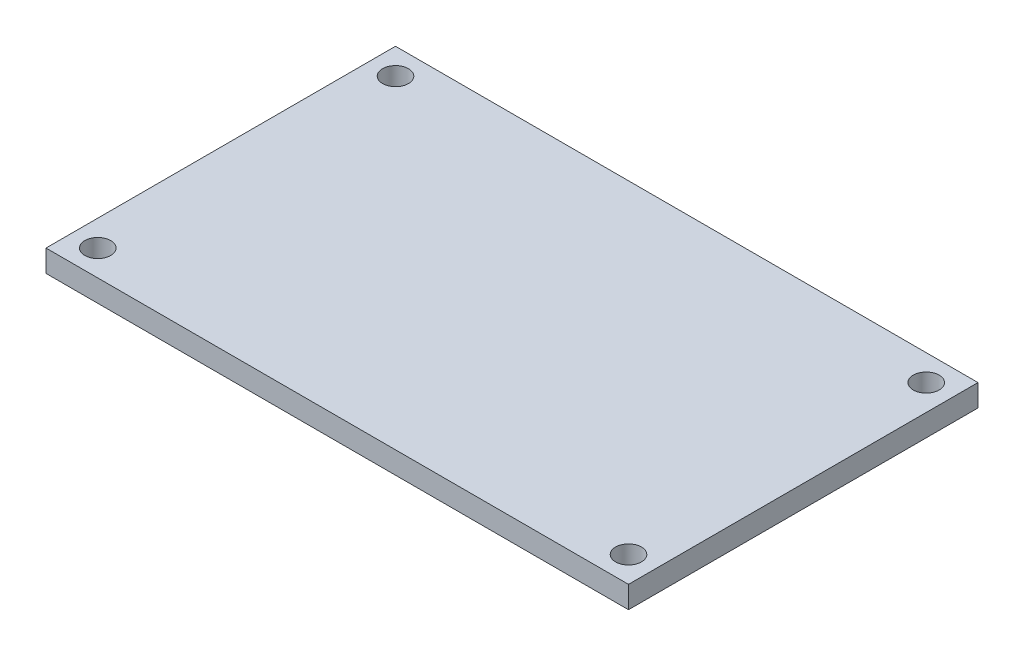
ISO-10303-21;
HEADER;
FILE_DESCRIPTION(('STEP AP214'),'2;1');
FILE_NAME('part.step','',(''),(''),'','','');
FILE_SCHEMA(('AUTOMOTIVE_DESIGN { 1 0 10303 214 1 1 1 1 }'));
ENDSEC;
DATA;
#1=APPLICATION_CONTEXT('core data for automotive mechanical design processes');
#2=APPLICATION_PROTOCOL_DEFINITION('international standard','automotive_design',2000,#1);
#3=PRODUCT_CONTEXT('',#1,'mechanical');
#4=PRODUCT('Part','Part','',(#3));
#5=PRODUCT_RELATED_PRODUCT_CATEGORY('part','',(#4));
#6=PRODUCT_DEFINITION_FORMATION('','',#4);
#7=PRODUCT_DEFINITION_CONTEXT('part definition',#1,'design');
#8=PRODUCT_DEFINITION('design','',#6,#7);
#9=PRODUCT_DEFINITION_SHAPE('','',#8);
#10=(LENGTH_UNIT() NAMED_UNIT(*) SI_UNIT(.MILLI.,.METRE.));
#11=(NAMED_UNIT(*) PLANE_ANGLE_UNIT() SI_UNIT($,.RADIAN.));
#12=(NAMED_UNIT(*) SI_UNIT($,.STERADIAN.) SOLID_ANGLE_UNIT());
#13=UNCERTAINTY_MEASURE_WITH_UNIT(LENGTH_MEASURE(1.E-05),#10,'distance_accuracy_value','');
#14=(GEOMETRIC_REPRESENTATION_CONTEXT(3) GLOBAL_UNCERTAINTY_ASSIGNED_CONTEXT((#13)) GLOBAL_UNIT_ASSIGNED_CONTEXT((#10,
#11,#12)) REPRESENTATION_CONTEXT('',''));
#15=CARTESIAN_POINT('',(0.,0.,0.));
#16=DIRECTION('',(0.,0.,1.));
#17=DIRECTION('',(1.,0.,0.));
#18=AXIS2_PLACEMENT_3D('',#15,#16,#17);
#19=CARTESIAN_POINT('',(0.,0.,-27.));
#20=DIRECTION('',(0.,-1.,0.));
#21=DIRECTION('',(0.,0.,-1.));
#22=AXIS2_PLACEMENT_3D('',#19,#20,#21);
#23=PLANE('',#22);
#24=CARTESIAN_POINT('',(2.,0.,-2.));
#25=DIRECTION('',(0.,-1.,0.));
#26=DIRECTION('',(0.,0.,1.));
#27=AXIS2_PLACEMENT_3D('',#24,#25,#26);
#28=CIRCLE('',#27,1.);
#29=CARTESIAN_POINT('',(2.,0.,-0.999999999999997));
#30=VERTEX_POINT('',#29);
#31=EDGE_CURVE('E263',#30,#30,#28,.T.);
#32=ORIENTED_EDGE('',*,*,#31,.F.);
#33=EDGE_LOOP('',(#32));
#34=FACE_BOUND('',#33,.T.);
#35=CARTESIAN_POINT('',(43.,0.,-2.00000000000002));
#36=DIRECTION('',(0.,-1.,0.));
#37=DIRECTION('',(0.,0.,-1.));
#38=AXIS2_PLACEMENT_3D('',#35,#36,#37);
#39=CIRCLE('',#38,0.999999999999998);
#40=CARTESIAN_POINT('',(43.,0.,-3.00000000000002));
#41=VERTEX_POINT('',#40);
#42=EDGE_CURVE('E265',#41,#41,#39,.T.);
#43=ORIENTED_EDGE('',*,*,#42,.F.);
#44=EDGE_LOOP('',(#43));
#45=FACE_BOUND('',#44,.T.);
#46=CARTESIAN_POINT('',(43.,0.,-25.));
#47=DIRECTION('',(0.,-1.,0.));
#48=DIRECTION('',(0.,0.,1.));
#49=AXIS2_PLACEMENT_3D('',#46,#47,#48);
#50=CIRCLE('',#49,0.999999999999998);
#51=CARTESIAN_POINT('',(43.,0.,-24.));
#52=VERTEX_POINT('',#51);
#53=EDGE_CURVE('E271',#52,#52,#50,.T.);
#54=ORIENTED_EDGE('',*,*,#53,.F.);
#55=EDGE_LOOP('',(#54));
#56=FACE_BOUND('',#55,.T.);
#57=CARTESIAN_POINT('',(2.,0.,-25.));
#58=DIRECTION('',(0.,-1.,0.));
#59=DIRECTION('',(0.,0.,-1.));
#60=AXIS2_PLACEMENT_3D('',#57,#58,#59);
#61=CIRCLE('',#60,1.);
#62=CARTESIAN_POINT('',(2.,0.,-26.));
#63=VERTEX_POINT('',#62);
#64=EDGE_CURVE('E277',#63,#63,#61,.T.);
#65=ORIENTED_EDGE('',*,*,#64,.F.);
#66=EDGE_LOOP('',(#65));
#67=FACE_BOUND('',#66,.T.);
#68=DIRECTION('',(0.,0.,1.));
#69=VECTOR('',#68,1.);
#70=CARTESIAN_POINT('',(0.,0.,0.));
#71=LINE('',#70,#69);
#72=CARTESIAN_POINT('',(0.,0.,-27.));
#73=VERTEX_POINT('',#72);
#74=CARTESIAN_POINT('',(0.,0.,0.));
#75=VERTEX_POINT('',#74);
#76=EDGE_CURVE('E157',#73,#75,#71,.T.);
#77=ORIENTED_EDGE('',*,*,#76,.F.);
#78=DIRECTION('',(-1.,0.,0.));
#79=VECTOR('',#78,1.);
#80=CARTESIAN_POINT('',(0.,0.,-27.));
#81=LINE('',#80,#79);
#82=CARTESIAN_POINT('',(45.,0.,-27.));
#83=VERTEX_POINT('',#82);
#84=EDGE_CURVE('E79',#83,#73,#81,.T.);
#85=ORIENTED_EDGE('',*,*,#84,.F.);
#86=DIRECTION('',(0.,0.,-1.));
#87=VECTOR('',#86,1.);
#88=CARTESIAN_POINT('',(45.,0.,0.));
#89=LINE('',#88,#87);
#90=CARTESIAN_POINT('',(45.,0.,0.));
#91=VERTEX_POINT('',#90);
#92=EDGE_CURVE('E174',#91,#83,#89,.T.);
#93=ORIENTED_EDGE('',*,*,#92,.F.);
#94=DIRECTION('',(1.,0.,0.));
#95=VECTOR('',#94,1.);
#96=CARTESIAN_POINT('',(0.,0.,0.));
#97=LINE('',#96,#95);
#98=EDGE_CURVE('E160',#75,#91,#97,.T.);
#99=ORIENTED_EDGE('',*,*,#98,.F.);
#100=EDGE_LOOP('',(#77,#85,#93,#99));
#101=FACE_BOUND('',#100,.T.);
#102=DIRECTION('',(0.707106781186547,0.,-0.707106781186548));
#103=VECTOR('',#102,1.);
#104=CARTESIAN_POINT('',(3.,0.,-22.5));
#105=LINE('',#104,#103);
#106=CARTESIAN_POINT('',(3.,0.,-22.5));
#107=VERTEX_POINT('',#106);
#108=CARTESIAN_POINT('',(5.,0.,-24.5));
#109=VERTEX_POINT('',#108);
#110=EDGE_CURVE('E297',#107,#109,#105,.T.);
#111=ORIENTED_EDGE('',*,*,#110,.F.);
#112=DIRECTION('',(0.,0.,-1.));
#113=VECTOR('',#112,1.);
#114=CARTESIAN_POINT('',(3.,0.,-4.5));
#115=LINE('',#114,#113);
#116=CARTESIAN_POINT('',(3.,0.,-4.5));
#117=VERTEX_POINT('',#116);
#118=EDGE_CURVE('E155',#117,#107,#115,.T.);
#119=ORIENTED_EDGE('',*,*,#118,.F.);
#120=DIRECTION('',(-0.707106781186547,0.,-0.707106781186548));
#121=VECTOR('',#120,1.);
#122=CARTESIAN_POINT('',(5.,0.,-2.5));
#123=LINE('',#122,#121);
#124=CARTESIAN_POINT('',(5.,0.,-2.5));
#125=VERTEX_POINT('',#124);
#126=EDGE_CURVE('E151',#125,#117,#123,.T.);
#127=ORIENTED_EDGE('',*,*,#126,.F.);
#128=DIRECTION('',(-1.,0.,0.));
#129=VECTOR('',#128,1.);
#130=CARTESIAN_POINT('',(5.,0.,-2.5));
#131=LINE('',#130,#129);
#132=CARTESIAN_POINT('',(40.,0.,-2.5));
#133=VERTEX_POINT('',#132);
#134=EDGE_CURVE('E307',#133,#125,#131,.T.);
#135=ORIENTED_EDGE('',*,*,#134,.F.);
#136=DIRECTION('',(-0.707106781186548,0.,0.707106781186547));
#137=VECTOR('',#136,1.);
#138=CARTESIAN_POINT('',(40.,0.,-2.5));
#139=LINE('',#138,#137);
#140=CARTESIAN_POINT('',(42.,0.,-4.5));
#141=VERTEX_POINT('',#140);
#142=EDGE_CURVE('E305',#141,#133,#139,.T.);
#143=ORIENTED_EDGE('',*,*,#142,.F.);
#144=DIRECTION('',(0.,0.,1.));
#145=VECTOR('',#144,1.);
#146=CARTESIAN_POINT('',(42.,0.,-4.5));
#147=LINE('',#146,#145);
#148=CARTESIAN_POINT('',(42.,0.,-22.5));
#149=VERTEX_POINT('',#148);
#150=EDGE_CURVE('E303',#149,#141,#147,.T.);
#151=ORIENTED_EDGE('',*,*,#150,.F.);
#152=DIRECTION('',(0.707106781186547,0.,0.707106781186547));
#153=VECTOR('',#152,1.);
#154=CARTESIAN_POINT('',(40.,0.,-24.5));
#155=LINE('',#154,#153);
#156=CARTESIAN_POINT('',(40.,0.,-24.5));
#157=VERTEX_POINT('',#156);
#158=EDGE_CURVE('E301',#157,#149,#155,.T.);
#159=ORIENTED_EDGE('',*,*,#158,.F.);
#160=DIRECTION('',(1.,0.,0.));
#161=VECTOR('',#160,1.);
#162=CARTESIAN_POINT('',(5.,0.,-24.5));
#163=LINE('',#162,#161);
#164=EDGE_CURVE('E299',#109,#157,#163,.T.);
#165=ORIENTED_EDGE('',*,*,#164,.F.);
#166=EDGE_LOOP('',(#111,#119,#127,#135,#143,#151,#159,#165));
#167=FACE_BOUND('',#166,.T.);
#168=ADVANCED_FACE('F34',(#34,#45,#56,#67,#101,#167),#23,.T.);
#169=CARTESIAN_POINT('',(0.,1.7,0.));
#170=DIRECTION('',(1.,0.,0.));
#171=DIRECTION('',(0.,0.,-1.));
#172=AXIS2_PLACEMENT_3D('',#169,#170,#171);
#173=PLANE('',#172);
#174=ORIENTED_EDGE('',*,*,#76,.T.);
#175=DIRECTION('',(0.,-1.,0.));
#176=VECTOR('',#175,1.);
#177=CARTESIAN_POINT('',(0.,1.7,0.));
#178=LINE('',#177,#176);
#179=CARTESIAN_POINT('',(0.,1.7,0.));
#180=VERTEX_POINT('',#179);
#181=EDGE_CURVE('E11',#180,#75,#178,.T.);
#182=ORIENTED_EDGE('',*,*,#181,.F.);
#183=DIRECTION('',(0.,0.,1.));
#184=VECTOR('',#183,1.);
#185=CARTESIAN_POINT('',(0.,1.7,0.));
#186=LINE('',#185,#184);
#187=CARTESIAN_POINT('',(0.,1.7,-27.));
#188=VERTEX_POINT('',#187);
#189=EDGE_CURVE('E166',#188,#180,#186,.T.);
#190=ORIENTED_EDGE('',*,*,#189,.F.);
#191=DIRECTION('',(0.,-1.,0.));
#192=VECTOR('',#191,1.);
#193=CARTESIAN_POINT('',(0.,1.7,-27.));
#194=LINE('',#193,#192);
#195=EDGE_CURVE('E171',#188,#73,#194,.T.);
#196=ORIENTED_EDGE('',*,*,#195,.T.);
#197=EDGE_LOOP('',(#174,#182,#190,#196));
#198=FACE_BOUND('',#197,.T.);
#199=ADVANCED_FACE('F36',(#198),#173,.F.);
#200=CARTESIAN_POINT('',(0.,1.7,0.));
#201=DIRECTION('',(0.,0.,-1.));
#202=DIRECTION('',(-1.,0.,0.));
#203=AXIS2_PLACEMENT_3D('',#200,#201,#202);
#204=PLANE('',#203);
#205=ORIENTED_EDGE('',*,*,#98,.T.);
#206=DIRECTION('',(0.,-1.,0.));
#207=VECTOR('',#206,1.);
#208=CARTESIAN_POINT('',(45.,1.7,0.));
#209=LINE('',#208,#207);
#210=CARTESIAN_POINT('',(45.,1.7,0.));
#211=VERTEX_POINT('',#210);
#212=EDGE_CURVE('E42',#211,#91,#209,.T.);
#213=ORIENTED_EDGE('',*,*,#212,.F.);
#214=DIRECTION('',(1.,0.,0.));
#215=VECTOR('',#214,1.);
#216=CARTESIAN_POINT('',(0.,1.7,0.));
#217=LINE('',#216,#215);
#218=EDGE_CURVE('E86',#180,#211,#217,.T.);
#219=ORIENTED_EDGE('',*,*,#218,.F.);
#220=ORIENTED_EDGE('',*,*,#181,.T.);
#221=EDGE_LOOP('',(#205,#213,#219,#220));
#222=FACE_BOUND('',#221,.T.);
#223=ADVANCED_FACE('F201',(#222),#204,.F.);
#224=CARTESIAN_POINT('',(45.,1.7,0.));
#225=DIRECTION('',(-1.,0.,0.));
#226=DIRECTION('',(0.,0.,1.));
#227=AXIS2_PLACEMENT_3D('',#224,#225,#226);
#228=PLANE('',#227);
#229=ORIENTED_EDGE('',*,*,#92,.T.);
#230=DIRECTION('',(0.,-1.,0.));
#231=VECTOR('',#230,1.);
#232=CARTESIAN_POINT('',(45.,1.7,-27.));
#233=LINE('',#232,#231);
#234=CARTESIAN_POINT('',(45.,1.7,-27.));
#235=VERTEX_POINT('',#234);
#236=EDGE_CURVE('E178',#235,#83,#233,.T.);
#237=ORIENTED_EDGE('',*,*,#236,.F.);
#238=DIRECTION('',(0.,0.,-1.));
#239=VECTOR('',#238,1.);
#240=CARTESIAN_POINT('',(45.,1.7,0.));
#241=LINE('',#240,#239);
#242=EDGE_CURVE('E169',#211,#235,#241,.T.);
#243=ORIENTED_EDGE('',*,*,#242,.F.);
#244=ORIENTED_EDGE('',*,*,#212,.T.);
#245=EDGE_LOOP('',(#229,#237,#243,#244));
#246=FACE_BOUND('',#245,.T.);
#247=ADVANCED_FACE('F183',(#246),#228,.F.);
#248=CARTESIAN_POINT('',(0.,1.7,-27.));
#249=DIRECTION('',(0.,0.,1.));
#250=DIRECTION('',(1.,0.,0.));
#251=AXIS2_PLACEMENT_3D('',#248,#249,#250);
#252=PLANE('',#251);
#253=ORIENTED_EDGE('',*,*,#84,.T.);
#254=ORIENTED_EDGE('',*,*,#195,.F.);
#255=DIRECTION('',(-1.,0.,0.));
#256=VECTOR('',#255,1.);
#257=CARTESIAN_POINT('',(0.,1.7,-27.));
#258=LINE('',#257,#256);
#259=EDGE_CURVE('E58',#235,#188,#258,.T.);
#260=ORIENTED_EDGE('',*,*,#259,.F.);
#261=ORIENTED_EDGE('',*,*,#236,.T.);
#262=EDGE_LOOP('',(#253,#254,#260,#261));
#263=FACE_BOUND('',#262,.T.);
#264=ADVANCED_FACE('F191',(#263),#252,.F.);
#265=CARTESIAN_POINT('',(0.,1.7,-27.));
#266=DIRECTION('',(0.,-1.,0.));
#267=DIRECTION('',(0.,0.,-1.));
#268=AXIS2_PLACEMENT_3D('',#265,#266,#267);
#269=PLANE('',#268);
#270=CARTESIAN_POINT('',(2.,1.7,-2.));
#271=DIRECTION('',(0.,-1.,0.));
#272=DIRECTION('',(0.,0.,1.));
#273=AXIS2_PLACEMENT_3D('',#270,#271,#272);
#274=CIRCLE('',#273,1.);
#275=CARTESIAN_POINT('',(2.,1.7,-0.999999999999997));
#276=VERTEX_POINT('',#275);
#277=EDGE_CURVE('E261',#276,#276,#274,.T.);
#278=ORIENTED_EDGE('',*,*,#277,.T.);
#279=EDGE_LOOP('',(#278));
#280=FACE_BOUND('',#279,.T.);
#281=CARTESIAN_POINT('',(43.,1.7,-2.00000000000002));
#282=DIRECTION('',(0.,-1.,0.));
#283=DIRECTION('',(0.,0.,-1.));
#284=AXIS2_PLACEMENT_3D('',#281,#282,#283);
#285=CIRCLE('',#284,0.999999999999998);
#286=CARTESIAN_POINT('',(43.,1.7,-3.00000000000002));
#287=VERTEX_POINT('',#286);
#288=EDGE_CURVE('E268',#287,#287,#285,.T.);
#289=ORIENTED_EDGE('',*,*,#288,.T.);
#290=EDGE_LOOP('',(#289));
#291=FACE_BOUND('',#290,.T.);
#292=CARTESIAN_POINT('',(43.,1.7,-25.));
#293=DIRECTION('',(0.,-1.,0.));
#294=DIRECTION('',(0.,0.,1.));
#295=AXIS2_PLACEMENT_3D('',#292,#293,#294);
#296=CIRCLE('',#295,0.999999999999998);
#297=CARTESIAN_POINT('',(43.,1.7,-24.));
#298=VERTEX_POINT('',#297);
#299=EDGE_CURVE('E274',#298,#298,#296,.T.);
#300=ORIENTED_EDGE('',*,*,#299,.T.);
#301=EDGE_LOOP('',(#300));
#302=FACE_BOUND('',#301,.T.);
#303=CARTESIAN_POINT('',(2.,1.7,-25.));
#304=DIRECTION('',(0.,-1.,0.));
#305=DIRECTION('',(0.,0.,-1.));
#306=AXIS2_PLACEMENT_3D('',#303,#304,#305);
#307=CIRCLE('',#306,1.);
#308=CARTESIAN_POINT('',(2.,1.7,-26.));
#309=VERTEX_POINT('',#308);
#310=EDGE_CURVE('E280',#309,#309,#307,.T.);
#311=ORIENTED_EDGE('',*,*,#310,.T.);
#312=EDGE_LOOP('',(#311));
#313=FACE_BOUND('',#312,.T.);
#314=ORIENTED_EDGE('',*,*,#189,.T.);
#315=ORIENTED_EDGE('',*,*,#218,.T.);
#316=ORIENTED_EDGE('',*,*,#242,.T.);
#317=ORIENTED_EDGE('',*,*,#259,.T.);
#318=EDGE_LOOP('',(#314,#315,#316,#317));
#319=FACE_BOUND('',#318,.T.);
#320=ADVANCED_FACE('F193',(#280,#291,#302,#313,#319),#269,.F.);
#321=CARTESIAN_POINT('',(3.,-1.,-4.5));
#322=DIRECTION('',(1.,0.,0.));
#323=DIRECTION('',(0.,0.,-1.));
#324=AXIS2_PLACEMENT_3D('',#321,#322,#323);
#325=PLANE('',#324);
#326=ORIENTED_EDGE('',*,*,#118,.T.);
#327=DIRECTION('',(0.,1.,0.));
#328=VECTOR('',#327,1.);
#329=CARTESIAN_POINT('',(3.,-1.,-22.5));
#330=LINE('',#329,#328);
#331=CARTESIAN_POINT('',(3.,-1.,-22.5));
#332=VERTEX_POINT('',#331);
#333=EDGE_CURVE('E136',#332,#107,#330,.T.);
#334=ORIENTED_EDGE('',*,*,#333,.F.);
#335=DIRECTION('',(0.,0.,-1.));
#336=VECTOR('',#335,1.);
#337=CARTESIAN_POINT('',(3.,-1.,-4.5));
#338=LINE('',#337,#336);
#339=CARTESIAN_POINT('',(3.,-1.,-4.5));
#340=VERTEX_POINT('',#339);
#341=EDGE_CURVE('E143',#340,#332,#338,.T.);
#342=ORIENTED_EDGE('',*,*,#341,.F.);
#343=DIRECTION('',(0.,1.,0.));
#344=VECTOR('',#343,1.);
#345=CARTESIAN_POINT('',(3.,-1.,-4.5));
#346=LINE('',#345,#344);
#347=EDGE_CURVE('E295',#340,#117,#346,.T.);
#348=ORIENTED_EDGE('',*,*,#347,.T.);
#349=EDGE_LOOP('',(#326,#334,#342,#348));
#350=FACE_BOUND('',#349,.T.);
#351=ADVANCED_FACE('F153',(#350),#325,.F.);
#352=CARTESIAN_POINT('',(3.,-1.,-22.5));
#353=DIRECTION('',(0.707106781186548,0.,0.707106781186547));
#354=DIRECTION('',(0.707106781186547,0.,-0.707106781186548));
#355=AXIS2_PLACEMENT_3D('',#352,#353,#354);
#356=PLANE('',#355);
#357=ORIENTED_EDGE('',*,*,#110,.T.);
#358=DIRECTION('',(0.,1.,0.));
#359=VECTOR('',#358,1.);
#360=CARTESIAN_POINT('',(5.,-1.,-24.5));
#361=LINE('',#360,#359);
#362=CARTESIAN_POINT('',(5.,-1.,-24.5));
#363=VERTEX_POINT('',#362);
#364=EDGE_CURVE('E139',#363,#109,#361,.T.);
#365=ORIENTED_EDGE('',*,*,#364,.F.);
#366=DIRECTION('',(0.707106781186547,0.,-0.707106781186548));
#367=VECTOR('',#366,1.);
#368=CARTESIAN_POINT('',(3.,-1.,-22.5));
#369=LINE('',#368,#367);
#370=EDGE_CURVE('E132',#332,#363,#369,.T.);
#371=ORIENTED_EDGE('',*,*,#370,.F.);
#372=ORIENTED_EDGE('',*,*,#333,.T.);
#373=EDGE_LOOP('',(#357,#365,#371,#372));
#374=FACE_BOUND('',#373,.T.);
#375=ADVANCED_FACE('F134',(#374),#356,.F.);
#376=CARTESIAN_POINT('',(5.,-1.,-24.5));
#377=DIRECTION('',(0.,0.,1.));
#378=DIRECTION('',(1.,0.,0.));
#379=AXIS2_PLACEMENT_3D('',#376,#377,#378);
#380=PLANE('',#379);
#381=ORIENTED_EDGE('',*,*,#164,.T.);
#382=DIRECTION('',(0.,1.,0.));
#383=VECTOR('',#382,1.);
#384=CARTESIAN_POINT('',(40.,-1.,-24.5));
#385=LINE('',#384,#383);
#386=CARTESIAN_POINT('',(40.,-1.,-24.5));
#387=VERTEX_POINT('',#386);
#388=EDGE_CURVE('E162',#387,#157,#385,.T.);
#389=ORIENTED_EDGE('',*,*,#388,.F.);
#390=DIRECTION('',(1.,0.,0.));
#391=VECTOR('',#390,1.);
#392=CARTESIAN_POINT('',(5.,-1.,-24.5));
#393=LINE('',#392,#391);
#394=EDGE_CURVE('E142',#363,#387,#393,.T.);
#395=ORIENTED_EDGE('',*,*,#394,.F.);
#396=ORIENTED_EDGE('',*,*,#364,.T.);
#397=EDGE_LOOP('',(#381,#389,#395,#396));
#398=FACE_BOUND('',#397,.T.);
#399=ADVANCED_FACE('F216',(#398),#380,.F.);
#400=CARTESIAN_POINT('',(40.,-1.,-24.5));
#401=DIRECTION('',(-0.707106781186547,0.,0.707106781186547));
#402=DIRECTION('',(0.707106781186548,0.,0.707106781186548));
#403=AXIS2_PLACEMENT_3D('',#400,#401,#402);
#404=PLANE('',#403);
#405=ORIENTED_EDGE('',*,*,#158,.T.);
#406=DIRECTION('',(0.,1.,0.));
#407=VECTOR('',#406,1.);
#408=CARTESIAN_POINT('',(42.,-1.,-22.5));
#409=LINE('',#408,#407);
#410=CARTESIAN_POINT('',(42.,-1.,-22.5));
#411=VERTEX_POINT('',#410);
#412=EDGE_CURVE('E318',#411,#149,#409,.T.);
#413=ORIENTED_EDGE('',*,*,#412,.F.);
#414=DIRECTION('',(0.707106781186547,0.,0.707106781186547));
#415=VECTOR('',#414,1.);
#416=CARTESIAN_POINT('',(40.,-1.,-24.5));
#417=LINE('',#416,#415);
#418=EDGE_CURVE('E286',#387,#411,#417,.T.);
#419=ORIENTED_EDGE('',*,*,#418,.F.);
#420=ORIENTED_EDGE('',*,*,#388,.T.);
#421=EDGE_LOOP('',(#405,#413,#419,#420));
#422=FACE_BOUND('',#421,.T.);
#423=ADVANCED_FACE('F219',(#422),#404,.F.);
#424=CARTESIAN_POINT('',(42.,-1.,-4.5));
#425=DIRECTION('',(-1.,0.,0.));
#426=DIRECTION('',(0.,0.,1.));
#427=AXIS2_PLACEMENT_3D('',#424,#425,#426);
#428=PLANE('',#427);
#429=ORIENTED_EDGE('',*,*,#150,.T.);
#430=DIRECTION('',(0.,1.,0.));
#431=VECTOR('',#430,1.);
#432=CARTESIAN_POINT('',(42.,-1.,-4.5));
#433=LINE('',#432,#431);
#434=CARTESIAN_POINT('',(42.,-1.,-4.5));
#435=VERTEX_POINT('',#434);
#436=EDGE_CURVE('E315',#435,#141,#433,.T.);
#437=ORIENTED_EDGE('',*,*,#436,.F.);
#438=DIRECTION('',(0.,0.,1.));
#439=VECTOR('',#438,1.);
#440=CARTESIAN_POINT('',(42.,-1.,-4.5));
#441=LINE('',#440,#439);
#442=EDGE_CURVE('E288',#411,#435,#441,.T.);
#443=ORIENTED_EDGE('',*,*,#442,.F.);
#444=ORIENTED_EDGE('',*,*,#412,.T.);
#445=EDGE_LOOP('',(#429,#437,#443,#444));
#446=FACE_BOUND('',#445,.T.);
#447=ADVANCED_FACE('F223',(#446),#428,.F.);
#448=CARTESIAN_POINT('',(40.,-1.,-2.5));
#449=DIRECTION('',(-0.707106781186547,0.,-0.707106781186548));
#450=DIRECTION('',(-0.707106781186548,0.,0.707106781186547));
#451=AXIS2_PLACEMENT_3D('',#448,#449,#450);
#452=PLANE('',#451);
#453=ORIENTED_EDGE('',*,*,#142,.T.);
#454=DIRECTION('',(0.,1.,0.));
#455=VECTOR('',#454,1.);
#456=CARTESIAN_POINT('',(40.,-1.,-2.5));
#457=LINE('',#456,#455);
#458=CARTESIAN_POINT('',(40.,-1.,-2.5));
#459=VERTEX_POINT('',#458);
#460=EDGE_CURVE('E312',#459,#133,#457,.T.);
#461=ORIENTED_EDGE('',*,*,#460,.F.);
#462=DIRECTION('',(-0.707106781186548,0.,0.707106781186547));
#463=VECTOR('',#462,1.);
#464=CARTESIAN_POINT('',(40.,-1.,-2.5));
#465=LINE('',#464,#463);
#466=EDGE_CURVE('E290',#435,#459,#465,.T.);
#467=ORIENTED_EDGE('',*,*,#466,.F.);
#468=ORIENTED_EDGE('',*,*,#436,.T.);
#469=EDGE_LOOP('',(#453,#461,#467,#468));
#470=FACE_BOUND('',#469,.T.);
#471=ADVANCED_FACE('F227',(#470),#452,.F.);
#472=CARTESIAN_POINT('',(5.,-1.,-2.5));
#473=DIRECTION('',(0.,0.,-1.));
#474=DIRECTION('',(-1.,0.,0.));
#475=AXIS2_PLACEMENT_3D('',#472,#473,#474);
#476=PLANE('',#475);
#477=ORIENTED_EDGE('',*,*,#134,.T.);
#478=DIRECTION('',(0.,1.,0.));
#479=VECTOR('',#478,1.);
#480=CARTESIAN_POINT('',(5.,-1.,-2.5));
#481=LINE('',#480,#479);
#482=CARTESIAN_POINT('',(5.,-1.,-2.5));
#483=VERTEX_POINT('',#482);
#484=EDGE_CURVE('E49',#483,#125,#481,.T.);
#485=ORIENTED_EDGE('',*,*,#484,.F.);
#486=DIRECTION('',(-1.,0.,0.));
#487=VECTOR('',#486,1.);
#488=CARTESIAN_POINT('',(5.,-1.,-2.5));
#489=LINE('',#488,#487);
#490=EDGE_CURVE('E292',#459,#483,#489,.T.);
#491=ORIENTED_EDGE('',*,*,#490,.F.);
#492=ORIENTED_EDGE('',*,*,#460,.T.);
#493=EDGE_LOOP('',(#477,#485,#491,#492));
#494=FACE_BOUND('',#493,.T.);
#495=ADVANCED_FACE('F231',(#494),#476,.F.);
#496=CARTESIAN_POINT('',(5.,-1.,-2.5));
#497=DIRECTION('',(0.707106781186548,0.,-0.707106781186547));
#498=DIRECTION('',(-0.707106781186547,0.,-0.707106781186548));
#499=AXIS2_PLACEMENT_3D('',#496,#497,#498);
#500=PLANE('',#499);
#501=ORIENTED_EDGE('',*,*,#126,.T.);
#502=ORIENTED_EDGE('',*,*,#347,.F.);
#503=DIRECTION('',(-0.707106781186547,0.,-0.707106781186548));
#504=VECTOR('',#503,1.);
#505=CARTESIAN_POINT('',(5.,-1.,-2.5));
#506=LINE('',#505,#504);
#507=EDGE_CURVE('E147',#483,#340,#506,.T.);
#508=ORIENTED_EDGE('',*,*,#507,.F.);
#509=ORIENTED_EDGE('',*,*,#484,.T.);
#510=EDGE_LOOP('',(#501,#502,#508,#509));
#511=FACE_BOUND('',#510,.T.);
#512=ADVANCED_FACE('F235',(#511),#500,.F.);
#513=CARTESIAN_POINT('',(3.,-1.,-24.5));
#514=DIRECTION('',(0.,-1.,0.));
#515=DIRECTION('',(0.,0.,-1.));
#516=AXIS2_PLACEMENT_3D('',#513,#514,#515);
#517=PLANE('',#516);
#518=ORIENTED_EDGE('',*,*,#341,.T.);
#519=ORIENTED_EDGE('',*,*,#370,.T.);
#520=ORIENTED_EDGE('',*,*,#394,.T.);
#521=ORIENTED_EDGE('',*,*,#418,.T.);
#522=ORIENTED_EDGE('',*,*,#442,.T.);
#523=ORIENTED_EDGE('',*,*,#466,.T.);
#524=ORIENTED_EDGE('',*,*,#490,.T.);
#525=ORIENTED_EDGE('',*,*,#507,.T.);
#526=EDGE_LOOP('',(#518,#519,#520,#521,#522,#523,#524,#525));
#527=FACE_BOUND('',#526,.T.);
#528=ADVANCED_FACE('F146',(#527),#517,.T.);
#529=CARTESIAN_POINT('',(2.,1.7,-25.));
#530=DIRECTION('',(0.,-1.,0.));
#531=DIRECTION('',(0.,0.,-1.));
#532=AXIS2_PLACEMENT_3D('',#529,#530,#531);
#533=CYLINDRICAL_SURFACE('',#532,1.);
#534=ORIENTED_EDGE('',*,*,#310,.F.);
#535=EDGE_LOOP('',(#534));
#536=FACE_BOUND('',#535,.T.);
#537=ORIENTED_EDGE('',*,*,#64,.T.);
#538=EDGE_LOOP('',(#537));
#539=FACE_BOUND('',#538,.T.);
#540=ADVANCED_FACE('F241',(#536,#539),#533,.F.);
#541=CARTESIAN_POINT('',(43.,1.7,-25.));
#542=DIRECTION('',(0.,-1.,0.));
#543=DIRECTION('',(0.,0.,-1.));
#544=AXIS2_PLACEMENT_3D('',#541,#542,#543);
#545=CYLINDRICAL_SURFACE('',#544,0.999999999999998);
#546=ORIENTED_EDGE('',*,*,#299,.F.);
#547=EDGE_LOOP('',(#546));
#548=FACE_BOUND('',#547,.T.);
#549=ORIENTED_EDGE('',*,*,#53,.T.);
#550=EDGE_LOOP('',(#549));
#551=FACE_BOUND('',#550,.T.);
#552=ADVANCED_FACE('F244',(#548,#551),#545,.F.);
#553=CARTESIAN_POINT('',(43.,1.7,-2.00000000000002));
#554=DIRECTION('',(0.,-1.,0.));
#555=DIRECTION('',(0.,0.,-1.));
#556=AXIS2_PLACEMENT_3D('',#553,#554,#555);
#557=CYLINDRICAL_SURFACE('',#556,0.999999999999998);
#558=ORIENTED_EDGE('',*,*,#288,.F.);
#559=EDGE_LOOP('',(#558));
#560=FACE_BOUND('',#559,.T.);
#561=ORIENTED_EDGE('',*,*,#42,.T.);
#562=EDGE_LOOP('',(#561));
#563=FACE_BOUND('',#562,.T.);
#564=ADVANCED_FACE('F248',(#560,#563),#557,.F.);
#565=CARTESIAN_POINT('',(2.,1.7,-2.));
#566=DIRECTION('',(0.,-1.,0.));
#567=DIRECTION('',(0.,0.,-1.));
#568=AXIS2_PLACEMENT_3D('',#565,#566,#567);
#569=CYLINDRICAL_SURFACE('',#568,1.);
#570=ORIENTED_EDGE('',*,*,#277,.F.);
#571=EDGE_LOOP('',(#570));
#572=FACE_BOUND('',#571,.T.);
#573=ORIENTED_EDGE('',*,*,#31,.T.);
#574=EDGE_LOOP('',(#573));
#575=FACE_BOUND('',#574,.T.);
#576=ADVANCED_FACE('F252',(#572,#575),#569,.F.);
#577=CLOSED_SHELL('',(#168,#199,#223,#247,#264,#320,#351,#375,#399,#423,#447,#471,#495,#512,
#528,#540,#552,#564,#576));
#578=MANIFOLD_SOLID_BREP('B2',#577);
#579=ADVANCED_BREP_SHAPE_REPRESENTATION('',(#18,#578),#14);
#580=SHAPE_DEFINITION_REPRESENTATION(#9,#579);
ENDSEC;
END-ISO-10303-21;
